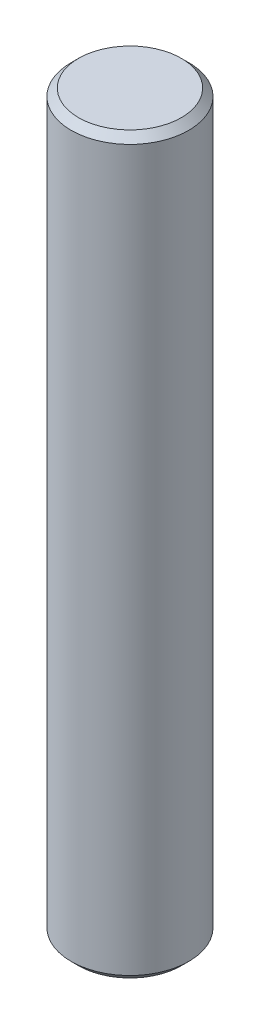
ISO-10303-21;
HEADER;
FILE_DESCRIPTION(('STEP AP214'),'2;1');
FILE_NAME('part.step','',(''),(''),'','','');
FILE_SCHEMA(('AUTOMOTIVE_DESIGN { 1 0 10303 214 1 1 1 1 }'));
ENDSEC;
DATA;
#1=APPLICATION_CONTEXT('core data for automotive mechanical design processes');
#2=APPLICATION_PROTOCOL_DEFINITION('international standard','automotive_design',2000,#1);
#3=PRODUCT_CONTEXT('',#1,'mechanical');
#4=PRODUCT('Part','Part','',(#3));
#5=PRODUCT_RELATED_PRODUCT_CATEGORY('part','',(#4));
#6=PRODUCT_DEFINITION_FORMATION('','',#4);
#7=PRODUCT_DEFINITION_CONTEXT('part definition',#1,'design');
#8=PRODUCT_DEFINITION('design','',#6,#7);
#9=PRODUCT_DEFINITION_SHAPE('','',#8);
#10=(LENGTH_UNIT() NAMED_UNIT(*) SI_UNIT(.MILLI.,.METRE.));
#11=(NAMED_UNIT(*) PLANE_ANGLE_UNIT() SI_UNIT($,.RADIAN.));
#12=(NAMED_UNIT(*) SI_UNIT($,.STERADIAN.) SOLID_ANGLE_UNIT());
#13=UNCERTAINTY_MEASURE_WITH_UNIT(LENGTH_MEASURE(1.E-05),#10,'distance_accuracy_value','');
#14=(GEOMETRIC_REPRESENTATION_CONTEXT(3) GLOBAL_UNCERTAINTY_ASSIGNED_CONTEXT((#13)) GLOBAL_UNIT_ASSIGNED_CONTEXT((#10,
#11,#12)) REPRESENTATION_CONTEXT('',''));
#15=CARTESIAN_POINT('',(0.,0.,0.));
#16=DIRECTION('',(0.,0.,1.));
#17=DIRECTION('',(1.,0.,0.));
#18=AXIS2_PLACEMENT_3D('',#15,#16,#17);
#19=CARTESIAN_POINT('',(0.,50.,0.));
#20=DIRECTION('',(0.,-1.,0.));
#21=DIRECTION('',(0.,0.,-1.));
#22=AXIS2_PLACEMENT_3D('',#19,#20,#21);
#23=CYLINDRICAL_SURFACE('',#22,4.);
#24=CARTESIAN_POINT('',(0.,0.499999999999987,0.));
#25=DIRECTION('',(0.,1.,0.));
#26=DIRECTION('',(0.,0.,1.));
#27=AXIS2_PLACEMENT_3D('',#24,#25,#26);
#28=CIRCLE('',#27,4.);
#29=CARTESIAN_POINT('',(0.,0.499999999999987,4.));
#30=VERTEX_POINT('',#29);
#31=EDGE_CURVE('E43',#30,#30,#28,.T.);
#32=ORIENTED_EDGE('',*,*,#31,.T.);
#33=EDGE_LOOP('',(#32));
#34=FACE_BOUND('',#33,.T.);
#35=CARTESIAN_POINT('',(0.,49.5,0.));
#36=DIRECTION('',(0.,1.,0.));
#37=DIRECTION('',(0.,0.,1.));
#38=AXIS2_PLACEMENT_3D('',#35,#36,#37);
#39=CIRCLE('',#38,4.);
#40=CARTESIAN_POINT('',(0.,49.5,4.));
#41=VERTEX_POINT('',#40);
#42=EDGE_CURVE('E47',#41,#41,#39,.F.);
#43=ORIENTED_EDGE('',*,*,#42,.T.);
#44=EDGE_LOOP('',(#43));
#45=FACE_BOUND('',#44,.T.);
#46=ADVANCED_FACE('F32',(#34,#45),#23,.T.);
#47=CARTESIAN_POINT('',(0.,50.,0.));
#48=DIRECTION('',(0.,1.,0.));
#49=DIRECTION('',(0.,0.,1.));
#50=AXIS2_PLACEMENT_3D('',#47,#48,#49);
#51=PLANE('',#50);
#52=CARTESIAN_POINT('',(0.,50.,0.));
#53=DIRECTION('',(0.,1.,0.));
#54=DIRECTION('',(0.,0.,1.));
#55=AXIS2_PLACEMENT_3D('',#52,#53,#54);
#56=CIRCLE('',#55,3.5);
#57=CARTESIAN_POINT('',(0.,50.,3.5));
#58=VERTEX_POINT('',#57);
#59=EDGE_CURVE('E10',#58,#58,#56,.T.);
#60=ORIENTED_EDGE('',*,*,#59,.T.);
#61=EDGE_LOOP('',(#60));
#62=FACE_BOUND('',#61,.T.);
#63=ADVANCED_FACE('F63',(#62),#51,.T.);
#64=CARTESIAN_POINT('',(0.,0.,0.));
#65=DIRECTION('',(0.,1.,0.));
#66=DIRECTION('',(0.,0.,1.));
#67=AXIS2_PLACEMENT_3D('',#64,#65,#66);
#68=PLANE('',#67);
#69=CARTESIAN_POINT('',(0.,0.,0.));
#70=DIRECTION('',(0.,1.,0.));
#71=DIRECTION('',(0.,0.,1.));
#72=AXIS2_PLACEMENT_3D('',#69,#70,#71);
#73=CIRCLE('',#72,3.50000000000002);
#74=CARTESIAN_POINT('',(0.,0.,3.50000000000002));
#75=VERTEX_POINT('',#74);
#76=EDGE_CURVE('E39',#75,#75,#73,.F.);
#77=ORIENTED_EDGE('',*,*,#76,.T.);
#78=EDGE_LOOP('',(#77));
#79=FACE_BOUND('',#78,.T.);
#80=ADVANCED_FACE('F60',(#79),#68,.F.);
#81=CARTESIAN_POINT('',(0.,0.499999999999987,0.));
#82=DIRECTION('',(0.,1.,0.));
#83=DIRECTION('',(0.,0.,1.));
#84=AXIS2_PLACEMENT_3D('',#81,#82,#83);
#85=CONICAL_SURFACE('',#84,4.,0.785398163397445);
#86=ORIENTED_EDGE('',*,*,#76,.F.);
#87=EDGE_LOOP('',(#86));
#88=FACE_BOUND('',#87,.T.);
#89=ORIENTED_EDGE('',*,*,#31,.F.);
#90=EDGE_LOOP('',(#89));
#91=FACE_BOUND('',#90,.T.);
#92=ADVANCED_FACE('F56',(#88,#91),#85,.T.);
#93=CARTESIAN_POINT('',(0.,50.,0.));
#94=DIRECTION('',(0.,-1.,0.));
#95=DIRECTION('',(0.,0.,-1.));
#96=AXIS2_PLACEMENT_3D('',#93,#94,#95);
#97=CONICAL_SURFACE('',#96,3.5,0.785398163397452);
#98=ORIENTED_EDGE('',*,*,#42,.F.);
#99=EDGE_LOOP('',(#98));
#100=FACE_BOUND('',#99,.T.);
#101=ORIENTED_EDGE('',*,*,#59,.F.);
#102=EDGE_LOOP('',(#101));
#103=FACE_BOUND('',#102,.T.);
#104=ADVANCED_FACE('F34',(#100,#103),#97,.T.);
#105=CLOSED_SHELL('',(#46,#63,#80,#92,#104));
#106=MANIFOLD_SOLID_BREP('B2',#105);
#107=ADVANCED_BREP_SHAPE_REPRESENTATION('',(#18,#106),#14);
#108=SHAPE_DEFINITION_REPRESENTATION(#9,#107);
ENDSEC;
END-ISO-10303-21;
